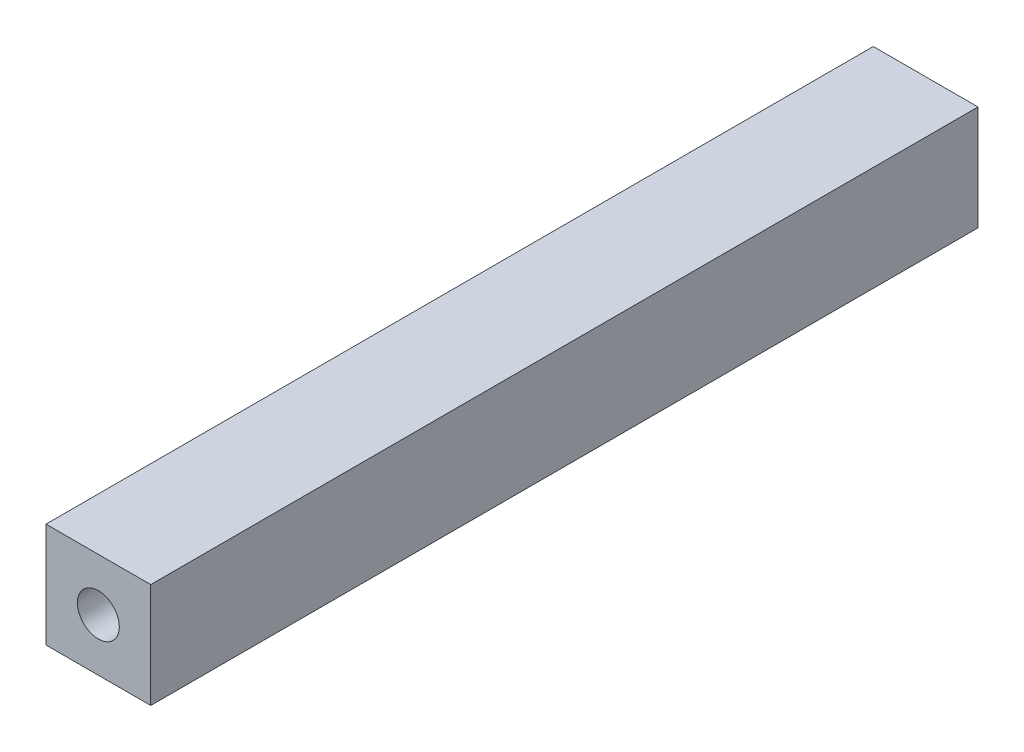
ISO-10303-21;
HEADER;
FILE_DESCRIPTION(('STEP AP214'),'2;1');
FILE_NAME('part.step','',(''),(''),'','','');
FILE_SCHEMA(('AUTOMOTIVE_DESIGN { 1 0 10303 214 1 1 1 1 }'));
ENDSEC;
DATA;
#1=APPLICATION_CONTEXT('core data for automotive mechanical design processes');
#2=APPLICATION_PROTOCOL_DEFINITION('international standard','automotive_design',2000,#1);
#3=PRODUCT_CONTEXT('',#1,'mechanical');
#4=PRODUCT('Part','Part','',(#3));
#5=PRODUCT_RELATED_PRODUCT_CATEGORY('part','',(#4));
#6=PRODUCT_DEFINITION_FORMATION('','',#4);
#7=PRODUCT_DEFINITION_CONTEXT('part definition',#1,'design');
#8=PRODUCT_DEFINITION('design','',#6,#7);
#9=PRODUCT_DEFINITION_SHAPE('','',#8);
#10=(LENGTH_UNIT() NAMED_UNIT(*) SI_UNIT(.MILLI.,.METRE.));
#11=(NAMED_UNIT(*) PLANE_ANGLE_UNIT() SI_UNIT($,.RADIAN.));
#12=(NAMED_UNIT(*) SI_UNIT($,.STERADIAN.) SOLID_ANGLE_UNIT());
#13=UNCERTAINTY_MEASURE_WITH_UNIT(LENGTH_MEASURE(1.E-05),#10,'distance_accuracy_value','');
#14=(GEOMETRIC_REPRESENTATION_CONTEXT(3) GLOBAL_UNCERTAINTY_ASSIGNED_CONTEXT((#13)) GLOBAL_UNIT_ASSIGNED_CONTEXT((#10,
#11,#12)) REPRESENTATION_CONTEXT('',''));
#15=CARTESIAN_POINT('',(0.,0.,0.));
#16=DIRECTION('',(0.,0.,1.));
#17=DIRECTION('',(1.,0.,0.));
#18=AXIS2_PLACEMENT_3D('',#15,#16,#17);
#19=CARTESIAN_POINT('',(0.,0.,79.));
#20=DIRECTION('',(0.,0.,-1.));
#21=DIRECTION('',(-1.,0.,0.));
#22=AXIS2_PLACEMENT_3D('',#19,#20,#21);
#23=PLANE('',#22);
#24=DIRECTION('',(0.,1.,0.));
#25=VECTOR('',#24,1.);
#26=CARTESIAN_POINT('',(5.,-5.,79.));
#27=LINE('',#26,#25);
#28=CARTESIAN_POINT('',(5.,-5.,79.));
#29=VERTEX_POINT('',#28);
#30=CARTESIAN_POINT('',(5.,5.,79.));
#31=VERTEX_POINT('',#30);
#32=EDGE_CURVE('E85',#29,#31,#27,.T.);
#33=ORIENTED_EDGE('',*,*,#32,.T.);
#34=DIRECTION('',(-1.,0.,0.));
#35=VECTOR('',#34,1.);
#36=CARTESIAN_POINT('',(-5.,5.,79.));
#37=LINE('',#36,#35);
#38=CARTESIAN_POINT('',(-5.,5.,79.));
#39=VERTEX_POINT('',#38);
#40=EDGE_CURVE('E80',#31,#39,#37,.T.);
#41=ORIENTED_EDGE('',*,*,#40,.T.);
#42=DIRECTION('',(0.,-1.,0.));
#43=VECTOR('',#42,1.);
#44=CARTESIAN_POINT('',(-5.,-5.,79.));
#45=LINE('',#44,#43);
#46=CARTESIAN_POINT('',(-5.,-5.,79.));
#47=VERTEX_POINT('',#46);
#48=EDGE_CURVE('E83',#39,#47,#45,.T.);
#49=ORIENTED_EDGE('',*,*,#48,.T.);
#50=DIRECTION('',(1.,0.,0.));
#51=VECTOR('',#50,1.);
#52=CARTESIAN_POINT('',(-5.,-5.,79.));
#53=LINE('',#52,#51);
#54=EDGE_CURVE('E50',#47,#29,#53,.T.);
#55=ORIENTED_EDGE('',*,*,#54,.T.);
#56=EDGE_LOOP('',(#33,#41,#49,#55));
#57=FACE_BOUND('',#56,.T.);
#58=CARTESIAN_POINT('',(0.,0.,79.));
#59=DIRECTION('',(0.,0.,1.));
#60=DIRECTION('',(1.,0.,0.));
#61=AXIS2_PLACEMENT_3D('',#58,#59,#60);
#62=CIRCLE('',#61,2.);
#63=CARTESIAN_POINT('',(2.,0.,79.));
#64=VERTEX_POINT('',#63);
#65=EDGE_CURVE('E100',#64,#64,#62,.T.);
#66=ORIENTED_EDGE('',*,*,#65,.F.);
#67=EDGE_LOOP('',(#66));
#68=FACE_BOUND('',#67,.T.);
#69=ADVANCED_FACE('F33',(#57,#68),#23,.F.);
#70=CARTESIAN_POINT('',(0.,0.,0.));
#71=DIRECTION('',(0.,0.,-1.));
#72=DIRECTION('',(-1.,0.,0.));
#73=AXIS2_PLACEMENT_3D('',#70,#71,#72);
#74=PLANE('',#73);
#75=DIRECTION('',(0.,1.,0.));
#76=VECTOR('',#75,1.);
#77=CARTESIAN_POINT('',(5.,-5.,0.));
#78=LINE('',#77,#76);
#79=CARTESIAN_POINT('',(5.,-5.,0.));
#80=VERTEX_POINT('',#79);
#81=CARTESIAN_POINT('',(5.,5.,0.));
#82=VERTEX_POINT('',#81);
#83=EDGE_CURVE('E97',#80,#82,#78,.T.);
#84=ORIENTED_EDGE('',*,*,#83,.F.);
#85=DIRECTION('',(1.,0.,0.));
#86=VECTOR('',#85,1.);
#87=CARTESIAN_POINT('',(-5.,-5.,0.));
#88=LINE('',#87,#86);
#89=CARTESIAN_POINT('',(-5.,-5.,0.));
#90=VERTEX_POINT('',#89);
#91=EDGE_CURVE('E73',#90,#80,#88,.T.);
#92=ORIENTED_EDGE('',*,*,#91,.F.);
#93=DIRECTION('',(0.,-1.,0.));
#94=VECTOR('',#93,1.);
#95=CARTESIAN_POINT('',(-5.,-5.,0.));
#96=LINE('',#95,#94);
#97=CARTESIAN_POINT('',(-5.,5.,0.));
#98=VERTEX_POINT('',#97);
#99=EDGE_CURVE('E67',#98,#90,#96,.T.);
#100=ORIENTED_EDGE('',*,*,#99,.F.);
#101=DIRECTION('',(-1.,0.,0.));
#102=VECTOR('',#101,1.);
#103=CARTESIAN_POINT('',(-5.,5.,0.));
#104=LINE('',#103,#102);
#105=EDGE_CURVE('E89',#82,#98,#104,.T.);
#106=ORIENTED_EDGE('',*,*,#105,.F.);
#107=EDGE_LOOP('',(#84,#92,#100,#106));
#108=FACE_BOUND('',#107,.T.);
#109=CARTESIAN_POINT('',(0.,0.,0.));
#110=DIRECTION('',(0.,0.,1.));
#111=DIRECTION('',(1.,0.,0.));
#112=AXIS2_PLACEMENT_3D('',#109,#110,#111);
#113=CIRCLE('',#112,2.);
#114=CARTESIAN_POINT('',(2.,0.,0.));
#115=VERTEX_POINT('',#114);
#116=EDGE_CURVE('E112',#115,#115,#113,.T.);
#117=ORIENTED_EDGE('',*,*,#116,.T.);
#118=EDGE_LOOP('',(#117));
#119=FACE_BOUND('',#118,.T.);
#120=ADVANCED_FACE('F108',(#108,#119),#74,.T.);
#121=CARTESIAN_POINT('',(5.,-5.,79.));
#122=DIRECTION('',(-1.,0.,0.));
#123=DIRECTION('',(0.,0.,1.));
#124=AXIS2_PLACEMENT_3D('',#121,#122,#123);
#125=PLANE('',#124);
#126=ORIENTED_EDGE('',*,*,#83,.T.);
#127=DIRECTION('',(0.,0.,-1.));
#128=VECTOR('',#127,1.);
#129=CARTESIAN_POINT('',(5.,5.,79.));
#130=LINE('',#129,#128);
#131=EDGE_CURVE('E11',#31,#82,#130,.T.);
#132=ORIENTED_EDGE('',*,*,#131,.F.);
#133=ORIENTED_EDGE('',*,*,#32,.F.);
#134=DIRECTION('',(0.,0.,-1.));
#135=VECTOR('',#134,1.);
#136=CARTESIAN_POINT('',(5.,-5.,79.));
#137=LINE('',#136,#135);
#138=EDGE_CURVE('E93',#29,#80,#137,.T.);
#139=ORIENTED_EDGE('',*,*,#138,.T.);
#140=EDGE_LOOP('',(#126,#132,#133,#139));
#141=FACE_BOUND('',#140,.T.);
#142=ADVANCED_FACE('F35',(#141),#125,.F.);
#143=CARTESIAN_POINT('',(-5.,5.,79.));
#144=DIRECTION('',(0.,-1.,0.));
#145=DIRECTION('',(0.,0.,-1.));
#146=AXIS2_PLACEMENT_3D('',#143,#144,#145);
#147=PLANE('',#146);
#148=ORIENTED_EDGE('',*,*,#105,.T.);
#149=DIRECTION('',(0.,0.,-1.));
#150=VECTOR('',#149,1.);
#151=CARTESIAN_POINT('',(-5.,5.,79.));
#152=LINE('',#151,#150);
#153=EDGE_CURVE('E42',#39,#98,#152,.T.);
#154=ORIENTED_EDGE('',*,*,#153,.F.);
#155=ORIENTED_EDGE('',*,*,#40,.F.);
#156=ORIENTED_EDGE('',*,*,#131,.T.);
#157=EDGE_LOOP('',(#148,#154,#155,#156));
#158=FACE_BOUND('',#157,.T.);
#159=ADVANCED_FACE('F88',(#158),#147,.F.);
#160=CARTESIAN_POINT('',(-5.,-5.,79.));
#161=DIRECTION('',(1.,0.,0.));
#162=DIRECTION('',(0.,0.,-1.));
#163=AXIS2_PLACEMENT_3D('',#160,#161,#162);
#164=PLANE('',#163);
#165=ORIENTED_EDGE('',*,*,#99,.T.);
#166=DIRECTION('',(0.,0.,-1.));
#167=VECTOR('',#166,1.);
#168=CARTESIAN_POINT('',(-5.,-5.,79.));
#169=LINE('',#168,#167);
#170=EDGE_CURVE('E90',#47,#90,#169,.T.);
#171=ORIENTED_EDGE('',*,*,#170,.F.);
#172=ORIENTED_EDGE('',*,*,#48,.F.);
#173=ORIENTED_EDGE('',*,*,#153,.T.);
#174=EDGE_LOOP('',(#165,#171,#172,#173));
#175=FACE_BOUND('',#174,.T.);
#176=ADVANCED_FACE('F91',(#175),#164,.F.);
#177=CARTESIAN_POINT('',(-5.,-5.,79.));
#178=DIRECTION('',(0.,1.,0.));
#179=DIRECTION('',(0.,0.,1.));
#180=AXIS2_PLACEMENT_3D('',#177,#178,#179);
#181=PLANE('',#180);
#182=ORIENTED_EDGE('',*,*,#91,.T.);
#183=ORIENTED_EDGE('',*,*,#138,.F.);
#184=ORIENTED_EDGE('',*,*,#54,.F.);
#185=ORIENTED_EDGE('',*,*,#170,.T.);
#186=EDGE_LOOP('',(#182,#183,#184,#185));
#187=FACE_BOUND('',#186,.T.);
#188=ADVANCED_FACE('F105',(#187),#181,.F.);
#189=CARTESIAN_POINT('',(0.,0.,79.));
#190=DIRECTION('',(0.,0.,-1.));
#191=DIRECTION('',(-1.,0.,0.));
#192=AXIS2_PLACEMENT_3D('',#189,#190,#191);
#193=CYLINDRICAL_SURFACE('',#192,2.);
#194=ORIENTED_EDGE('',*,*,#65,.T.);
#195=EDGE_LOOP('',(#194));
#196=FACE_BOUND('',#195,.T.);
#197=ORIENTED_EDGE('',*,*,#116,.F.);
#198=EDGE_LOOP('',(#197));
#199=FACE_BOUND('',#198,.T.);
#200=ADVANCED_FACE('F118',(#196,#199),#193,.F.);
#201=CLOSED_SHELL('',(#69,#120,#142,#159,#176,#188,#200));
#202=MANIFOLD_SOLID_BREP('B2',#201);
#203=ADVANCED_BREP_SHAPE_REPRESENTATION('',(#18,#202),#14);
#204=SHAPE_DEFINITION_REPRESENTATION(#9,#203);
ENDSEC;
END-ISO-10303-21;
